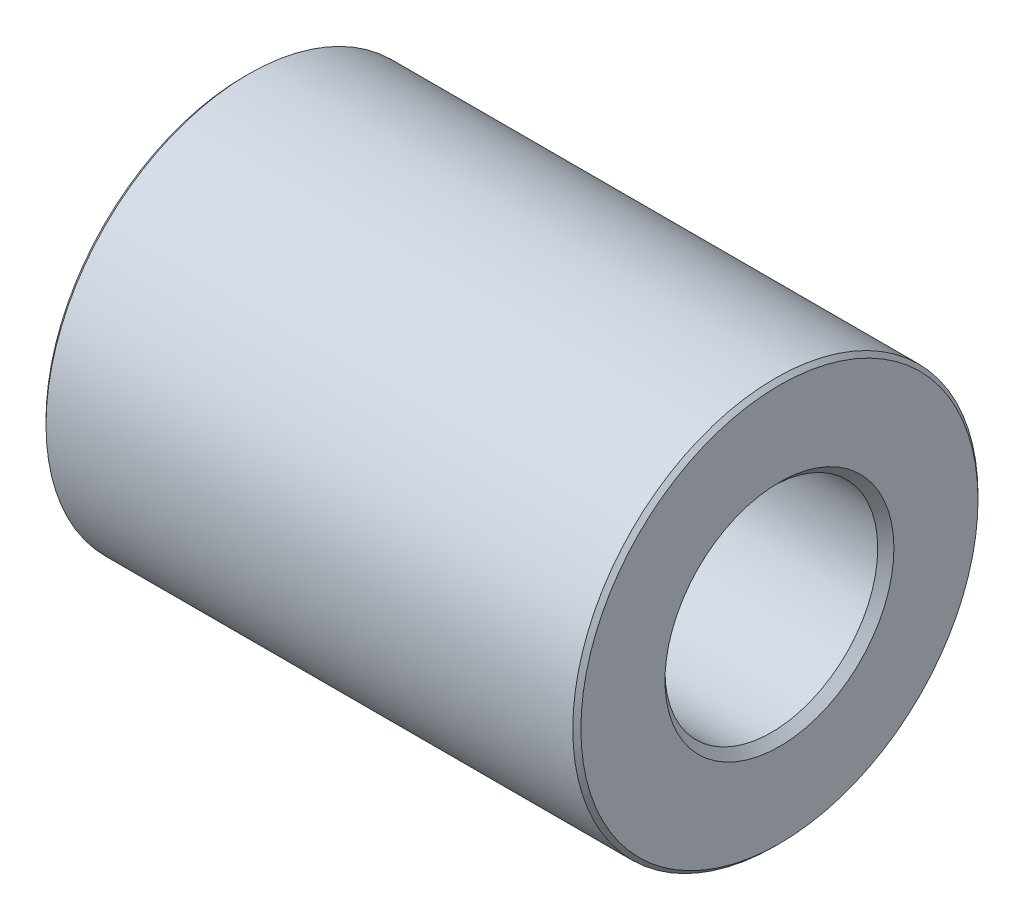
ISO-10303-21;
HEADER;
FILE_DESCRIPTION(('STEP AP214'),'2;1');
FILE_NAME('part.step','',(''),(''),'','','');
FILE_SCHEMA(('AUTOMOTIVE_DESIGN { 1 0 10303 214 1 1 1 1 }'));
ENDSEC;
DATA;
#1=APPLICATION_CONTEXT('core data for automotive mechanical design processes');
#2=APPLICATION_PROTOCOL_DEFINITION('international standard','automotive_design',2000,#1);
#3=PRODUCT_CONTEXT('',#1,'mechanical');
#4=PRODUCT('Part','Part','',(#3));
#5=PRODUCT_RELATED_PRODUCT_CATEGORY('part','',(#4));
#6=PRODUCT_DEFINITION_FORMATION('','',#4);
#7=PRODUCT_DEFINITION_CONTEXT('part definition',#1,'design');
#8=PRODUCT_DEFINITION('design','',#6,#7);
#9=PRODUCT_DEFINITION_SHAPE('','',#8);
#10=(LENGTH_UNIT() NAMED_UNIT(*) SI_UNIT(.MILLI.,.METRE.));
#11=(NAMED_UNIT(*) PLANE_ANGLE_UNIT() SI_UNIT($,.RADIAN.));
#12=(NAMED_UNIT(*) SI_UNIT($,.STERADIAN.) SOLID_ANGLE_UNIT());
#13=UNCERTAINTY_MEASURE_WITH_UNIT(LENGTH_MEASURE(1.E-05),#10,'distance_accuracy_value','');
#14=(GEOMETRIC_REPRESENTATION_CONTEXT(3) GLOBAL_UNCERTAINTY_ASSIGNED_CONTEXT((#13)) GLOBAL_UNIT_ASSIGNED_CONTEXT((#10,
#11,#12)) REPRESENTATION_CONTEXT('',''));
#15=CARTESIAN_POINT('',(0.,0.,0.));
#16=DIRECTION('',(0.,0.,1.));
#17=DIRECTION('',(1.,0.,0.));
#18=AXIS2_PLACEMENT_3D('',#15,#16,#17);
#19=CARTESIAN_POINT('',(6.6,0.,0.));
#20=DIRECTION('',(1.,0.,0.));
#21=DIRECTION('',(0.,0.,-1.));
#22=AXIS2_PLACEMENT_3D('',#19,#20,#21);
#23=PLANE('',#22);
#24=CARTESIAN_POINT('',(6.6,0.,0.));
#25=DIRECTION('',(1.,0.,0.));
#26=DIRECTION('',(0.,0.,-1.));
#27=AXIS2_PLACEMENT_3D('',#24,#25,#26);
#28=CIRCLE('',#27,2.825);
#29=CARTESIAN_POINT('',(6.6,0.,-2.825));
#30=VERTEX_POINT('',#29);
#31=EDGE_CURVE('E8',#30,#30,#28,.F.);
#32=ORIENTED_EDGE('',*,*,#31,.T.);
#33=EDGE_LOOP('',(#32));
#34=FACE_BOUND('',#33,.T.);
#35=CARTESIAN_POINT('',(6.6,0.,0.));
#36=DIRECTION('',(1.,0.,0.));
#37=DIRECTION('',(0.,0.,-1.));
#38=AXIS2_PLACEMENT_3D('',#35,#36,#37);
#39=CIRCLE('',#38,4.9);
#40=CARTESIAN_POINT('',(6.6,0.,-4.9));
#41=VERTEX_POINT('',#40);
#42=EDGE_CURVE('E25',#41,#41,#39,.T.);
#43=ORIENTED_EDGE('',*,*,#42,.T.);
#44=EDGE_LOOP('',(#43));
#45=FACE_BOUND('',#44,.T.);
#46=ADVANCED_FACE('F13',(#34,#45),#23,.T.);
#47=CARTESIAN_POINT('',(-6.6,0.,0.));
#48=DIRECTION('',(1.,0.,0.));
#49=DIRECTION('',(0.,0.,-1.));
#50=AXIS2_PLACEMENT_3D('',#47,#48,#49);
#51=PLANE('',#50);
#52=CARTESIAN_POINT('',(-6.6,0.,0.));
#53=DIRECTION('',(1.,0.,0.));
#54=DIRECTION('',(0.,0.,-1.));
#55=AXIS2_PLACEMENT_3D('',#52,#53,#54);
#56=CIRCLE('',#55,4.9);
#57=CARTESIAN_POINT('',(-6.6,0.,-4.9));
#58=VERTEX_POINT('',#57);
#59=EDGE_CURVE('E29',#58,#58,#56,.F.);
#60=ORIENTED_EDGE('',*,*,#59,.T.);
#61=EDGE_LOOP('',(#60));
#62=FACE_BOUND('',#61,.T.);
#63=CARTESIAN_POINT('',(-6.6,0.,0.));
#64=DIRECTION('',(1.,0.,0.));
#65=DIRECTION('',(0.,0.,-1.));
#66=AXIS2_PLACEMENT_3D('',#63,#64,#65);
#67=CIRCLE('',#66,2.625);
#68=CARTESIAN_POINT('',(-6.6,0.,-2.625));
#69=VERTEX_POINT('',#68);
#70=EDGE_CURVE('E40',#69,#69,#67,.T.);
#71=ORIENTED_EDGE('',*,*,#70,.T.);
#72=EDGE_LOOP('',(#71));
#73=FACE_BOUND('',#72,.T.);
#74=ADVANCED_FACE('F44',(#62,#73),#51,.F.);
#75=CARTESIAN_POINT('',(6.6,0.,0.));
#76=DIRECTION('',(-1.,0.,0.));
#77=DIRECTION('',(0.,0.,1.));
#78=AXIS2_PLACEMENT_3D('',#75,#76,#77);
#79=CYLINDRICAL_SURFACE('',#78,5.);
#80=CARTESIAN_POINT('',(-6.5,0.,0.));
#81=DIRECTION('',(1.,0.,0.));
#82=DIRECTION('',(0.,0.,-1.));
#83=AXIS2_PLACEMENT_3D('',#80,#81,#82);
#84=CIRCLE('',#83,5.);
#85=CARTESIAN_POINT('',(-6.5,0.,-5.));
#86=VERTEX_POINT('',#85);
#87=EDGE_CURVE('E34',#86,#86,#84,.T.);
#88=ORIENTED_EDGE('',*,*,#87,.T.);
#89=EDGE_LOOP('',(#88));
#90=FACE_BOUND('',#89,.T.);
#91=CARTESIAN_POINT('',(6.5,0.,0.));
#92=DIRECTION('',(1.,0.,0.));
#93=DIRECTION('',(0.,0.,-1.));
#94=AXIS2_PLACEMENT_3D('',#91,#92,#93);
#95=CIRCLE('',#94,5.);
#96=CARTESIAN_POINT('',(6.5,0.,-5.));
#97=VERTEX_POINT('',#96);
#98=EDGE_CURVE('E37',#97,#97,#95,.F.);
#99=ORIENTED_EDGE('',*,*,#98,.T.);
#100=EDGE_LOOP('',(#99));
#101=FACE_BOUND('',#100,.T.);
#102=ADVANCED_FACE('F49',(#90,#101),#79,.T.);
#103=CARTESIAN_POINT('',(6.6,0.,0.));
#104=DIRECTION('',(-1.,0.,0.));
#105=DIRECTION('',(0.,0.,1.));
#106=AXIS2_PLACEMENT_3D('',#103,#104,#105);
#107=CYLINDRICAL_SURFACE('',#106,2.625);
#108=CARTESIAN_POINT('',(6.4,0.,0.));
#109=DIRECTION('',(1.,0.,0.));
#110=DIRECTION('',(0.,0.,-1.));
#111=AXIS2_PLACEMENT_3D('',#108,#109,#110);
#112=CIRCLE('',#111,2.625);
#113=CARTESIAN_POINT('',(6.4,0.,-2.625));
#114=VERTEX_POINT('',#113);
#115=EDGE_CURVE('E21',#114,#114,#112,.T.);
#116=ORIENTED_EDGE('',*,*,#115,.T.);
#117=EDGE_LOOP('',(#116));
#118=FACE_BOUND('',#117,.T.);
#119=ORIENTED_EDGE('',*,*,#70,.F.);
#120=EDGE_LOOP('',(#119));
#121=FACE_BOUND('',#120,.T.);
#122=ADVANCED_FACE('F46',(#118,#121),#107,.F.);
#123=CARTESIAN_POINT('',(-6.5,0.,0.));
#124=DIRECTION('',(1.,0.,0.));
#125=DIRECTION('',(0.,0.,-1.));
#126=AXIS2_PLACEMENT_3D('',#123,#124,#125);
#127=CONICAL_SURFACE('',#126,5.,0.78539816339744);
#128=ORIENTED_EDGE('',*,*,#59,.F.);
#129=EDGE_LOOP('',(#128));
#130=FACE_BOUND('',#129,.T.);
#131=ORIENTED_EDGE('',*,*,#87,.F.);
#132=EDGE_LOOP('',(#131));
#133=FACE_BOUND('',#132,.T.);
#134=ADVANCED_FACE('F48',(#130,#133),#127,.T.);
#135=CARTESIAN_POINT('',(6.6,0.,0.));
#136=DIRECTION('',(-1.,0.,0.));
#137=DIRECTION('',(0.,0.,1.));
#138=AXIS2_PLACEMENT_3D('',#135,#136,#137);
#139=CONICAL_SURFACE('',#138,4.9,0.785398163397435);
#140=ORIENTED_EDGE('',*,*,#98,.F.);
#141=EDGE_LOOP('',(#140));
#142=FACE_BOUND('',#141,.T.);
#143=ORIENTED_EDGE('',*,*,#42,.F.);
#144=EDGE_LOOP('',(#143));
#145=FACE_BOUND('',#144,.T.);
#146=ADVANCED_FACE('F56',(#142,#145),#139,.T.);
#147=CARTESIAN_POINT('',(6.4,0.,0.));
#148=DIRECTION('',(1.,0.,0.));
#149=DIRECTION('',(0.,0.,-1.));
#150=AXIS2_PLACEMENT_3D('',#147,#148,#149);
#151=CONICAL_SURFACE('',#150,2.625,0.785398163397449);
#152=ORIENTED_EDGE('',*,*,#31,.F.);
#153=EDGE_LOOP('',(#152));
#154=FACE_BOUND('',#153,.T.);
#155=ORIENTED_EDGE('',*,*,#115,.F.);
#156=EDGE_LOOP('',(#155));
#157=FACE_BOUND('',#156,.T.);
#158=ADVANCED_FACE('F16',(#154,#157),#151,.F.);
#159=CLOSED_SHELL('',(#46,#74,#102,#122,#134,#146,#158));
#160=MANIFOLD_SOLID_BREP('B1',#159);
#161=ADVANCED_BREP_SHAPE_REPRESENTATION('',(#18,#160),#14);
#162=SHAPE_DEFINITION_REPRESENTATION(#9,#161);
ENDSEC;
END-ISO-10303-21;
